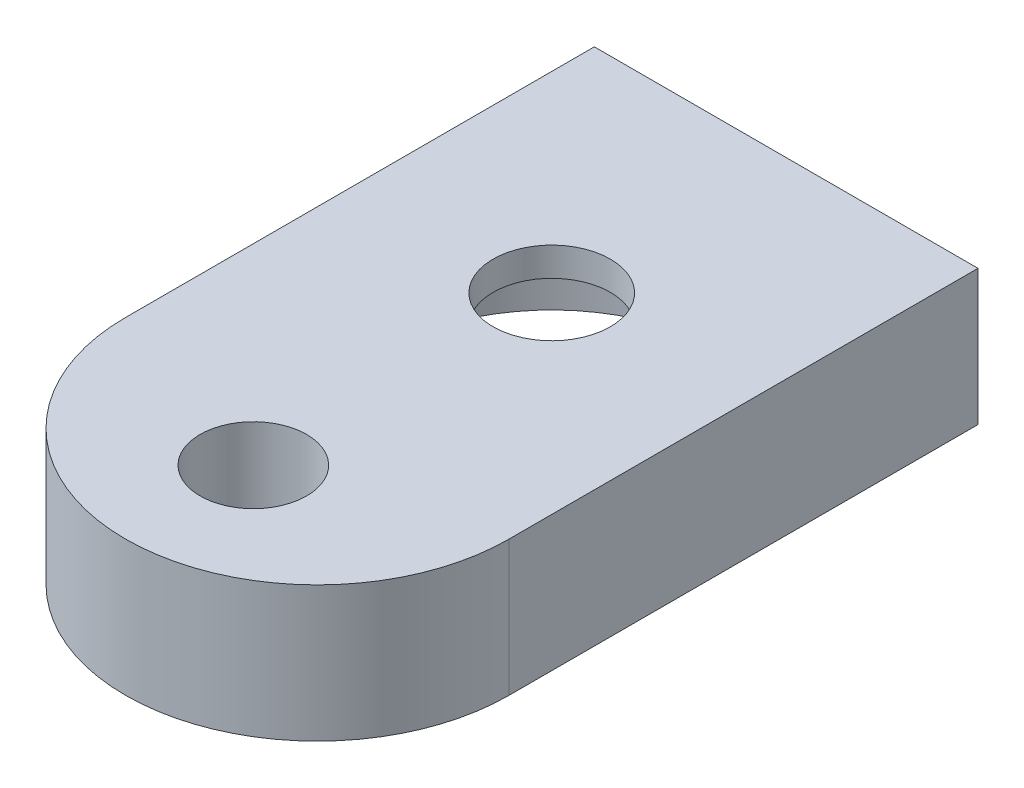
ISO-10303-21;
HEADER;
FILE_DESCRIPTION(('STEP AP214'),'2;1');
FILE_NAME('part.step','',(''),(''),'','','');
FILE_SCHEMA(('AUTOMOTIVE_DESIGN { 1 0 10303 214 1 1 1 1 }'));
ENDSEC;
DATA;
#1=APPLICATION_CONTEXT('core data for automotive mechanical design processes');
#2=APPLICATION_PROTOCOL_DEFINITION('international standard','automotive_design',2000,#1);
#3=PRODUCT_CONTEXT('',#1,'mechanical');
#4=PRODUCT('Part','Part','',(#3));
#5=PRODUCT_RELATED_PRODUCT_CATEGORY('part','',(#4));
#6=PRODUCT_DEFINITION_FORMATION('','',#4);
#7=PRODUCT_DEFINITION_CONTEXT('part definition',#1,'design');
#8=PRODUCT_DEFINITION('design','',#6,#7);
#9=PRODUCT_DEFINITION_SHAPE('','',#8);
#10=(LENGTH_UNIT() NAMED_UNIT(*) SI_UNIT(.MILLI.,.METRE.));
#11=(NAMED_UNIT(*) PLANE_ANGLE_UNIT() SI_UNIT($,.RADIAN.));
#12=(NAMED_UNIT(*) SI_UNIT($,.STERADIAN.) SOLID_ANGLE_UNIT());
#13=UNCERTAINTY_MEASURE_WITH_UNIT(LENGTH_MEASURE(1.E-05),#10,'distance_accuracy_value','');
#14=(GEOMETRIC_REPRESENTATION_CONTEXT(3) GLOBAL_UNCERTAINTY_ASSIGNED_CONTEXT((#13)) GLOBAL_UNIT_ASSIGNED_CONTEXT((#10,
#11,#12)) REPRESENTATION_CONTEXT('',''));
#15=CARTESIAN_POINT('',(0.,0.,0.));
#16=DIRECTION('',(0.,0.,1.));
#17=DIRECTION('',(1.,0.,0.));
#18=AXIS2_PLACEMENT_3D('',#15,#16,#17);
#19=CARTESIAN_POINT('',(-9.,6.35,-11.));
#20=DIRECTION('',(1.,0.,0.));
#21=DIRECTION('',(0.,0.,-1.));
#22=AXIS2_PLACEMENT_3D('',#19,#20,#21);
#23=PLANE('',#22);
#24=DIRECTION('',(0.,0.,1.));
#25=VECTOR('',#24,1.);
#26=CARTESIAN_POINT('',(-9.,0.,-11.));
#27=LINE('',#26,#25);
#28=CARTESIAN_POINT('',(-9.,0.,-11.));
#29=VERTEX_POINT('',#28);
#30=CARTESIAN_POINT('',(-9.,0.,11.));
#31=VERTEX_POINT('',#30);
#32=EDGE_CURVE('E96',#29,#31,#27,.T.);
#33=ORIENTED_EDGE('',*,*,#32,.T.);
#34=DIRECTION('',(0.,-1.,0.));
#35=VECTOR('',#34,1.);
#36=CARTESIAN_POINT('',(-9.,6.35,11.));
#37=LINE('',#36,#35);
#38=CARTESIAN_POINT('',(-9.,6.35,11.));
#39=VERTEX_POINT('',#38);
#40=EDGE_CURVE('E11',#39,#31,#37,.T.);
#41=ORIENTED_EDGE('',*,*,#40,.F.);
#42=DIRECTION('',(0.,0.,1.));
#43=VECTOR('',#42,1.);
#44=CARTESIAN_POINT('',(-9.,6.35,-11.));
#45=LINE('',#44,#43);
#46=CARTESIAN_POINT('',(-9.,6.35,-11.));
#47=VERTEX_POINT('',#46);
#48=EDGE_CURVE('E84',#47,#39,#45,.T.);
#49=ORIENTED_EDGE('',*,*,#48,.F.);
#50=DIRECTION('',(0.,-1.,0.));
#51=VECTOR('',#50,1.);
#52=CARTESIAN_POINT('',(-9.,6.35,-11.));
#53=LINE('',#52,#51);
#54=EDGE_CURVE('E92',#47,#29,#53,.T.);
#55=ORIENTED_EDGE('',*,*,#54,.T.);
#56=EDGE_LOOP('',(#33,#41,#49,#55));
#57=FACE_BOUND('',#56,.T.);
#58=ADVANCED_FACE('F33',(#57),#23,.F.);
#59=CARTESIAN_POINT('',(0.,6.35,11.));
#60=DIRECTION('',(0.,-1.,0.));
#61=DIRECTION('',(0.,0.,-1.));
#62=AXIS2_PLACEMENT_3D('',#59,#60,#61);
#63=CYLINDRICAL_SURFACE('',#62,9.);
#64=CARTESIAN_POINT('',(0.,0.,11.));
#65=DIRECTION('',(0.,1.,0.));
#66=DIRECTION('',(0.,0.,1.));
#67=AXIS2_PLACEMENT_3D('',#64,#65,#66);
#68=CIRCLE('',#67,9.);
#69=CARTESIAN_POINT('',(9.,0.,11.));
#70=VERTEX_POINT('',#69);
#71=EDGE_CURVE('E88',#31,#70,#68,.T.);
#72=ORIENTED_EDGE('',*,*,#71,.T.);
#73=DIRECTION('',(0.,-1.,0.));
#74=VECTOR('',#73,1.);
#75=CARTESIAN_POINT('',(9.,6.35,11.));
#76=LINE('',#75,#74);
#77=CARTESIAN_POINT('',(9.,6.35,11.));
#78=VERTEX_POINT('',#77);
#79=EDGE_CURVE('E41',#78,#70,#76,.T.);
#80=ORIENTED_EDGE('',*,*,#79,.F.);
#81=CARTESIAN_POINT('',(0.,6.35,11.));
#82=DIRECTION('',(0.,1.,0.));
#83=DIRECTION('',(0.,0.,1.));
#84=AXIS2_PLACEMENT_3D('',#81,#82,#83);
#85=CIRCLE('',#84,9.);
#86=EDGE_CURVE('E79',#39,#78,#85,.T.);
#87=ORIENTED_EDGE('',*,*,#86,.F.);
#88=ORIENTED_EDGE('',*,*,#40,.T.);
#89=EDGE_LOOP('',(#72,#80,#87,#88));
#90=FACE_BOUND('',#89,.T.);
#91=ADVANCED_FACE('F87',(#90),#63,.T.);
#92=CARTESIAN_POINT('',(9.,6.35,11.));
#93=DIRECTION('',(-1.,0.,0.));
#94=DIRECTION('',(0.,0.,1.));
#95=AXIS2_PLACEMENT_3D('',#92,#93,#94);
#96=PLANE('',#95);
#97=DIRECTION('',(0.,0.,-1.));
#98=VECTOR('',#97,1.);
#99=CARTESIAN_POINT('',(9.,0.,11.));
#100=LINE('',#99,#98);
#101=CARTESIAN_POINT('',(9.,0.,-11.));
#102=VERTEX_POINT('',#101);
#103=EDGE_CURVE('E66',#70,#102,#100,.T.);
#104=ORIENTED_EDGE('',*,*,#103,.T.);
#105=DIRECTION('',(0.,-1.,0.));
#106=VECTOR('',#105,1.);
#107=CARTESIAN_POINT('',(9.,6.35,-11.));
#108=LINE('',#107,#106);
#109=CARTESIAN_POINT('',(9.,6.35,-11.));
#110=VERTEX_POINT('',#109);
#111=EDGE_CURVE('E89',#110,#102,#108,.T.);
#112=ORIENTED_EDGE('',*,*,#111,.F.);
#113=DIRECTION('',(0.,0.,-1.));
#114=VECTOR('',#113,1.);
#115=CARTESIAN_POINT('',(9.,6.35,11.));
#116=LINE('',#115,#114);
#117=EDGE_CURVE('E82',#78,#110,#116,.T.);
#118=ORIENTED_EDGE('',*,*,#117,.F.);
#119=ORIENTED_EDGE('',*,*,#79,.T.);
#120=EDGE_LOOP('',(#104,#112,#118,#119));
#121=FACE_BOUND('',#120,.T.);
#122=ADVANCED_FACE('F90',(#121),#96,.F.);
#123=CARTESIAN_POINT('',(9.,6.35,-11.));
#124=DIRECTION('',(0.,0.,1.));
#125=DIRECTION('',(1.,0.,0.));
#126=AXIS2_PLACEMENT_3D('',#123,#124,#125);
#127=PLANE('',#126);
#128=ORIENTED_EDGE('',*,*,#54,.F.);
#129=DIRECTION('',(-1.,0.,0.));
#130=VECTOR('',#129,1.);
#131=CARTESIAN_POINT('',(9.,6.35,-11.));
#132=LINE('',#131,#130);
#133=EDGE_CURVE('E49',#110,#47,#132,.T.);
#134=ORIENTED_EDGE('',*,*,#133,.F.);
#135=ORIENTED_EDGE('',*,*,#111,.T.);
#136=DIRECTION('',(-1.,0.,0.));
#137=VECTOR('',#136,1.);
#138=CARTESIAN_POINT('',(9.,0.,-11.));
#139=LINE('',#138,#137);
#140=EDGE_CURVE('E72',#102,#29,#139,.T.);
#141=ORIENTED_EDGE('',*,*,#140,.T.);
#142=EDGE_LOOP('',(#128,#134,#135,#141));
#143=FACE_BOUND('',#142,.T.);
#144=ADVANCED_FACE('F104',(#143),#127,.F.);
#145=CARTESIAN_POINT('',(0.,6.35,11.));
#146=DIRECTION('',(0.,1.,0.));
#147=DIRECTION('',(0.,0.,1.));
#148=AXIS2_PLACEMENT_3D('',#145,#146,#147);
#149=PLANE('',#148);
#150=CARTESIAN_POINT('',(0.,6.35,14.));
#151=DIRECTION('',(0.,-1.,0.));
#152=DIRECTION('',(0.,0.,-1.));
#153=AXIS2_PLACEMENT_3D('',#150,#151,#152);
#154=CIRCLE('',#153,2.5);
#155=CARTESIAN_POINT('',(0.,6.35,11.5));
#156=VERTEX_POINT('',#155);
#157=EDGE_CURVE('E119',#156,#156,#154,.T.);
#158=ORIENTED_EDGE('',*,*,#157,.T.);
#159=EDGE_LOOP('',(#158));
#160=FACE_BOUND('',#159,.T.);
#161=CARTESIAN_POINT('',(0.,6.35,0.));
#162=DIRECTION('',(0.,-1.,0.));
#163=DIRECTION('',(0.,0.,-1.));
#164=AXIS2_PLACEMENT_3D('',#161,#162,#163);
#165=CIRCLE('',#164,2.75);
#166=CARTESIAN_POINT('',(0.,6.35,-2.75));
#167=VERTEX_POINT('',#166);
#168=EDGE_CURVE('E113',#167,#167,#165,.T.);
#169=ORIENTED_EDGE('',*,*,#168,.T.);
#170=EDGE_LOOP('',(#169));
#171=FACE_BOUND('',#170,.T.);
#172=ORIENTED_EDGE('',*,*,#48,.T.);
#173=ORIENTED_EDGE('',*,*,#86,.T.);
#174=ORIENTED_EDGE('',*,*,#117,.T.);
#175=ORIENTED_EDGE('',*,*,#133,.T.);
#176=EDGE_LOOP('',(#172,#173,#174,#175));
#177=FACE_BOUND('',#176,.T.);
#178=ADVANCED_FACE('F80',(#160,#171,#177),#149,.T.);
#179=CARTESIAN_POINT('',(0.,0.,11.));
#180=DIRECTION('',(0.,1.,0.));
#181=DIRECTION('',(0.,0.,1.));
#182=AXIS2_PLACEMENT_3D('',#179,#180,#181);
#183=PLANE('',#182);
#184=CARTESIAN_POINT('',(0.,0.,14.));
#185=DIRECTION('',(0.,-1.,0.));
#186=DIRECTION('',(0.,0.,-1.));
#187=AXIS2_PLACEMENT_3D('',#184,#185,#186);
#188=CIRCLE('',#187,2.5);
#189=CARTESIAN_POINT('',(0.,0.,11.5));
#190=VERTEX_POINT('',#189);
#191=EDGE_CURVE('E122',#190,#190,#188,.T.);
#192=ORIENTED_EDGE('',*,*,#191,.F.);
#193=EDGE_LOOP('',(#192));
#194=FACE_BOUND('',#193,.T.);
#195=CARTESIAN_POINT('',(0.,0.,0.));
#196=DIRECTION('',(0.,-1.,0.));
#197=DIRECTION('',(0.,0.,-1.));
#198=AXIS2_PLACEMENT_3D('',#195,#196,#197);
#199=CIRCLE('',#198,8.);
#200=CARTESIAN_POINT('',(0.,0.,-8.));
#201=VERTEX_POINT('',#200);
#202=EDGE_CURVE('E110',#201,#201,#199,.T.);
#203=ORIENTED_EDGE('',*,*,#202,.F.);
#204=EDGE_LOOP('',(#203));
#205=FACE_BOUND('',#204,.T.);
#206=ORIENTED_EDGE('',*,*,#32,.F.);
#207=ORIENTED_EDGE('',*,*,#140,.F.);
#208=ORIENTED_EDGE('',*,*,#103,.F.);
#209=ORIENTED_EDGE('',*,*,#71,.F.);
#210=EDGE_LOOP('',(#206,#207,#208,#209));
#211=FACE_BOUND('',#210,.T.);
#212=ADVANCED_FACE('F107',(#194,#205,#211),#183,.F.);
#213=CARTESIAN_POINT('',(0.,5.,0.));
#214=DIRECTION('',(0.,-1.,0.));
#215=DIRECTION('',(0.,0.,-1.));
#216=AXIS2_PLACEMENT_3D('',#213,#214,#215);
#217=CYLINDRICAL_SURFACE('',#216,8.);
#218=CARTESIAN_POINT('',(0.,5.,0.));
#219=DIRECTION('',(0.,-1.,0.));
#220=DIRECTION('',(0.,0.,-1.));
#221=AXIS2_PLACEMENT_3D('',#218,#219,#220);
#222=CIRCLE('',#221,8.);
#223=CARTESIAN_POINT('',(0.,5.,-8.));
#224=VERTEX_POINT('',#223);
#225=EDGE_CURVE('E99',#224,#224,#222,.T.);
#226=ORIENTED_EDGE('',*,*,#225,.F.);
#227=EDGE_LOOP('',(#226));
#228=FACE_BOUND('',#227,.T.);
#229=ORIENTED_EDGE('',*,*,#202,.T.);
#230=EDGE_LOOP('',(#229));
#231=FACE_BOUND('',#230,.T.);
#232=ADVANCED_FACE('F139',(#228,#231),#217,.F.);
#233=CARTESIAN_POINT('',(0.,5.,0.));
#234=DIRECTION('',(0.,-1.,0.));
#235=DIRECTION('',(0.,0.,-1.));
#236=AXIS2_PLACEMENT_3D('',#233,#234,#235);
#237=PLANE('',#236);
#238=CARTESIAN_POINT('',(0.,5.,0.));
#239=DIRECTION('',(0.,-1.,0.));
#240=DIRECTION('',(0.,0.,-1.));
#241=AXIS2_PLACEMENT_3D('',#238,#239,#240);
#242=CIRCLE('',#241,2.75);
#243=CARTESIAN_POINT('',(0.,5.,-2.75));
#244=VERTEX_POINT('',#243);
#245=EDGE_CURVE('E116',#244,#244,#242,.T.);
#246=ORIENTED_EDGE('',*,*,#245,.F.);
#247=EDGE_LOOP('',(#246));
#248=FACE_BOUND('',#247,.T.);
#249=ORIENTED_EDGE('',*,*,#225,.T.);
#250=EDGE_LOOP('',(#249));
#251=FACE_BOUND('',#250,.T.);
#252=ADVANCED_FACE('F144',(#248,#251),#237,.T.);
#253=CARTESIAN_POINT('',(0.,6.35,0.));
#254=DIRECTION('',(0.,-1.,0.));
#255=DIRECTION('',(0.,0.,-1.));
#256=AXIS2_PLACEMENT_3D('',#253,#254,#255);
#257=CYLINDRICAL_SURFACE('',#256,2.75);
#258=ORIENTED_EDGE('',*,*,#168,.F.);
#259=EDGE_LOOP('',(#258));
#260=FACE_BOUND('',#259,.T.);
#261=ORIENTED_EDGE('',*,*,#245,.T.);
#262=EDGE_LOOP('',(#261));
#263=FACE_BOUND('',#262,.T.);
#264=ADVANCED_FACE('F133',(#260,#263),#257,.F.);
#265=CARTESIAN_POINT('',(0.,6.35,14.));
#266=DIRECTION('',(0.,-1.,0.));
#267=DIRECTION('',(0.,0.,-1.));
#268=AXIS2_PLACEMENT_3D('',#265,#266,#267);
#269=CYLINDRICAL_SURFACE('',#268,2.5);
#270=ORIENTED_EDGE('',*,*,#157,.F.);
#271=EDGE_LOOP('',(#270));
#272=FACE_BOUND('',#271,.T.);
#273=ORIENTED_EDGE('',*,*,#191,.T.);
#274=EDGE_LOOP('',(#273));
#275=FACE_BOUND('',#274,.T.);
#276=ADVANCED_FACE('F130',(#272,#275),#269,.F.);
#277=CLOSED_SHELL('',(#58,#91,#122,#144,#178,#212,#232,#252,#264,#276));
#278=MANIFOLD_SOLID_BREP('B2',#277);
#279=ADVANCED_BREP_SHAPE_REPRESENTATION('',(#18,#278),#14);
#280=SHAPE_DEFINITION_REPRESENTATION(#9,#279);
ENDSEC;
END-ISO-10303-21;
